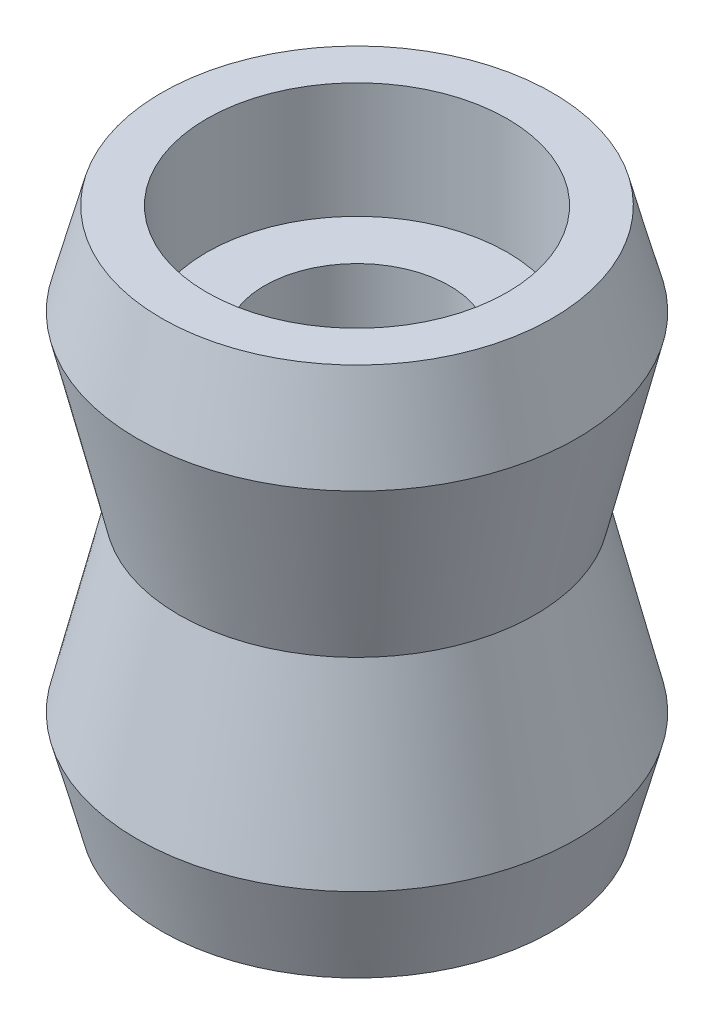
ISO-10303-21;
HEADER;
FILE_DESCRIPTION(('STEP AP214'),'2;1');
FILE_NAME('part.step','',(''),(''),'','','');
FILE_SCHEMA(('AUTOMOTIVE_DESIGN { 1 0 10303 214 1 1 1 1 }'));
ENDSEC;
DATA;
#1=APPLICATION_CONTEXT('core data for automotive mechanical design processes');
#2=APPLICATION_PROTOCOL_DEFINITION('international standard','automotive_design',2000,#1);
#3=PRODUCT_CONTEXT('',#1,'mechanical');
#4=PRODUCT('Part','Part','',(#3));
#5=PRODUCT_RELATED_PRODUCT_CATEGORY('part','',(#4));
#6=PRODUCT_DEFINITION_FORMATION('','',#4);
#7=PRODUCT_DEFINITION_CONTEXT('part definition',#1,'design');
#8=PRODUCT_DEFINITION('design','',#6,#7);
#9=PRODUCT_DEFINITION_SHAPE('','',#8);
#10=(LENGTH_UNIT() NAMED_UNIT(*) SI_UNIT(.MILLI.,.METRE.));
#11=(NAMED_UNIT(*) PLANE_ANGLE_UNIT() SI_UNIT($,.RADIAN.));
#12=(NAMED_UNIT(*) SI_UNIT($,.STERADIAN.) SOLID_ANGLE_UNIT());
#13=UNCERTAINTY_MEASURE_WITH_UNIT(LENGTH_MEASURE(1.E-05),#10,'distance_accuracy_value','');
#14=(GEOMETRIC_REPRESENTATION_CONTEXT(3) GLOBAL_UNCERTAINTY_ASSIGNED_CONTEXT((#13)) GLOBAL_UNIT_ASSIGNED_CONTEXT((#10,
#11,#12)) REPRESENTATION_CONTEXT('',''));
#15=CARTESIAN_POINT('',(0.,0.,0.));
#16=DIRECTION('',(0.,0.,1.));
#17=DIRECTION('',(1.,0.,0.));
#18=AXIS2_PLACEMENT_3D('',#15,#16,#17);
#19=CARTESIAN_POINT('',(0.,-8.28436697366508,0.));
#20=DIRECTION('',(0.,1.,0.));
#21=DIRECTION('',(0.,0.,1.));
#22=AXIS2_PLACEMENT_3D('',#19,#20,#21);
#23=CONICAL_SURFACE('',#22,8.44834512402877,0.258536651886108);
#24=CARTESIAN_POINT('',(0.,-4.30768321840881,0.));
#25=DIRECTION('',(0.,1.,0.));
#26=DIRECTION('',(0.,0.,1.));
#27=AXIS2_PLACEMENT_3D('',#24,#25,#26);
#28=CIRCLE('',#27,9.5);
#29=CARTESIAN_POINT('',(0.,-4.30768321840881,9.5));
#30=VERTEX_POINT('',#29);
#31=EDGE_CURVE('E68',#30,#30,#28,.T.);
#32=ORIENTED_EDGE('',*,*,#31,.F.);
#33=EDGE_LOOP('',(#32));
#34=FACE_BOUND('',#33,.T.);
#35=CARTESIAN_POINT('',(0.,-8.28436697366508,0.));
#36=DIRECTION('',(0.,1.,0.));
#37=DIRECTION('',(0.,0.,1.));
#38=AXIS2_PLACEMENT_3D('',#35,#36,#37);
#39=CIRCLE('',#38,8.44834512402877);
#40=CARTESIAN_POINT('',(0.,-8.28436697366508,8.44834512402877));
#41=VERTEX_POINT('',#40);
#42=EDGE_CURVE('E10',#41,#41,#39,.T.);
#43=ORIENTED_EDGE('',*,*,#42,.T.);
#44=EDGE_LOOP('',(#43));
#45=FACE_BOUND('',#44,.T.);
#46=ADVANCED_FACE('F31',(#34,#45),#23,.T.);
#47=CARTESIAN_POINT('',(6.5,-8.28436697366508,0.));
#48=DIRECTION('',(0.,1.,0.));
#49=DIRECTION('',(0.,0.,1.));
#50=AXIS2_PLACEMENT_3D('',#47,#48,#49);
#51=PLANE('',#50);
#52=ORIENTED_EDGE('',*,*,#42,.F.);
#53=EDGE_LOOP('',(#52));
#54=FACE_BOUND('',#53,.T.);
#55=CARTESIAN_POINT('',(0.,-8.28436697366508,0.));
#56=DIRECTION('',(0.,1.,0.));
#57=DIRECTION('',(0.,0.,1.));
#58=AXIS2_PLACEMENT_3D('',#55,#56,#57);
#59=CIRCLE('',#58,6.5);
#60=CARTESIAN_POINT('',(0.,-8.28436697366508,6.5));
#61=VERTEX_POINT('',#60);
#62=EDGE_CURVE('E37',#61,#61,#59,.T.);
#63=ORIENTED_EDGE('',*,*,#62,.T.);
#64=EDGE_LOOP('',(#63));
#65=FACE_BOUND('',#64,.T.);
#66=ADVANCED_FACE('F75',(#54,#65),#51,.F.);
#67=CARTESIAN_POINT('',(0.,42.3234558477177,0.));
#68=DIRECTION('',(0.,1.,0.));
#69=DIRECTION('',(0.,0.,1.));
#70=AXIS2_PLACEMENT_3D('',#67,#68,#69);
#71=CYLINDRICAL_SURFACE('',#70,6.5);
#72=ORIENTED_EDGE('',*,*,#62,.F.);
#73=EDGE_LOOP('',(#72));
#74=FACE_BOUND('',#73,.T.);
#75=CARTESIAN_POINT('',(0.,-3.28436697366508,0.));
#76=DIRECTION('',(0.,1.,0.));
#77=DIRECTION('',(0.,0.,1.));
#78=AXIS2_PLACEMENT_3D('',#75,#76,#77);
#79=CIRCLE('',#78,6.5);
#80=CARTESIAN_POINT('',(0.,-3.28436697366508,6.5));
#81=VERTEX_POINT('',#80);
#82=EDGE_CURVE('E41',#81,#81,#79,.T.);
#83=ORIENTED_EDGE('',*,*,#82,.T.);
#84=EDGE_LOOP('',(#83));
#85=FACE_BOUND('',#84,.T.);
#86=ADVANCED_FACE('F79',(#74,#85),#71,.F.);
#87=CARTESIAN_POINT('',(4.,-3.28436697366508,0.));
#88=DIRECTION('',(0.,1.,0.));
#89=DIRECTION('',(0.,0.,1.));
#90=AXIS2_PLACEMENT_3D('',#87,#88,#89);
#91=PLANE('',#90);
#92=ORIENTED_EDGE('',*,*,#82,.F.);
#93=EDGE_LOOP('',(#92));
#94=FACE_BOUND('',#93,.T.);
#95=CARTESIAN_POINT('',(0.,-3.28436697366508,0.));
#96=DIRECTION('',(0.,1.,0.));
#97=DIRECTION('',(0.,0.,1.));
#98=AXIS2_PLACEMENT_3D('',#95,#96,#97);
#99=CIRCLE('',#98,4.);
#100=CARTESIAN_POINT('',(0.,-3.28436697366508,4.));
#101=VERTEX_POINT('',#100);
#102=EDGE_CURVE('E45',#101,#101,#99,.T.);
#103=ORIENTED_EDGE('',*,*,#102,.T.);
#104=EDGE_LOOP('',(#103));
#105=FACE_BOUND('',#104,.T.);
#106=ADVANCED_FACE('F84',(#94,#105),#91,.F.);
#107=CARTESIAN_POINT('',(0.,42.3234558477177,0.));
#108=DIRECTION('',(0.,1.,0.));
#109=DIRECTION('',(0.,0.,1.));
#110=AXIS2_PLACEMENT_3D('',#107,#108,#109);
#111=CYLINDRICAL_SURFACE('',#110,4.);
#112=ORIENTED_EDGE('',*,*,#102,.F.);
#113=EDGE_LOOP('',(#112));
#114=FACE_BOUND('',#113,.T.);
#115=CARTESIAN_POINT('',(0.,9.66900053684746,0.));
#116=DIRECTION('',(0.,1.,0.));
#117=DIRECTION('',(0.,0.,1.));
#118=AXIS2_PLACEMENT_3D('',#115,#116,#117);
#119=CIRCLE('',#118,4.);
#120=CARTESIAN_POINT('',(0.,9.66900053684746,4.));
#121=VERTEX_POINT('',#120);
#122=EDGE_CURVE('E50',#121,#121,#119,.T.);
#123=ORIENTED_EDGE('',*,*,#122,.T.);
#124=EDGE_LOOP('',(#123));
#125=FACE_BOUND('',#124,.T.);
#126=ADVANCED_FACE('F90',(#114,#125),#111,.F.);
#127=CARTESIAN_POINT('',(4.,9.66900053684746,0.));
#128=DIRECTION('',(0.,-1.,0.));
#129=DIRECTION('',(0.,0.,-1.));
#130=AXIS2_PLACEMENT_3D('',#127,#128,#129);
#131=PLANE('',#130);
#132=ORIENTED_EDGE('',*,*,#122,.F.);
#133=EDGE_LOOP('',(#132));
#134=FACE_BOUND('',#133,.T.);
#135=CARTESIAN_POINT('',(0.,9.66900053684746,0.));
#136=DIRECTION('',(0.,1.,0.));
#137=DIRECTION('',(0.,0.,1.));
#138=AXIS2_PLACEMENT_3D('',#135,#136,#137);
#139=CIRCLE('',#138,6.5);
#140=CARTESIAN_POINT('',(0.,9.66900053684746,6.5));
#141=VERTEX_POINT('',#140);
#142=EDGE_CURVE('E53',#141,#141,#139,.T.);
#143=ORIENTED_EDGE('',*,*,#142,.T.);
#144=EDGE_LOOP('',(#143));
#145=FACE_BOUND('',#144,.T.);
#146=ADVANCED_FACE('F94',(#134,#145),#131,.F.);
#147=CARTESIAN_POINT('',(0.,42.3234558477177,0.));
#148=DIRECTION('',(0.,1.,0.));
#149=DIRECTION('',(0.,0.,1.));
#150=AXIS2_PLACEMENT_3D('',#147,#148,#149);
#151=CYLINDRICAL_SURFACE('',#150,6.5);
#152=ORIENTED_EDGE('',*,*,#142,.F.);
#153=EDGE_LOOP('',(#152));
#154=FACE_BOUND('',#153,.T.);
#155=CARTESIAN_POINT('',(0.,14.6690005368475,0.));
#156=DIRECTION('',(0.,1.,0.));
#157=DIRECTION('',(0.,0.,1.));
#158=AXIS2_PLACEMENT_3D('',#155,#156,#157);
#159=CIRCLE('',#158,6.5);
#160=CARTESIAN_POINT('',(0.,14.6690005368475,6.5));
#161=VERTEX_POINT('',#160);
#162=EDGE_CURVE('E56',#161,#161,#159,.T.);
#163=ORIENTED_EDGE('',*,*,#162,.T.);
#164=EDGE_LOOP('',(#163));
#165=FACE_BOUND('',#164,.T.);
#166=ADVANCED_FACE('F98',(#154,#165),#151,.F.);
#167=CARTESIAN_POINT('',(6.5,14.6690005368475,0.));
#168=DIRECTION('',(0.,-1.,0.));
#169=DIRECTION('',(0.,0.,-1.));
#170=AXIS2_PLACEMENT_3D('',#167,#168,#169);
#171=PLANE('',#170);
#172=ORIENTED_EDGE('',*,*,#162,.F.);
#173=EDGE_LOOP('',(#172));
#174=FACE_BOUND('',#173,.T.);
#175=CARTESIAN_POINT('',(0.,14.6690005368475,0.));
#176=DIRECTION('',(0.,1.,0.));
#177=DIRECTION('',(0.,0.,1.));
#178=AXIS2_PLACEMENT_3D('',#175,#176,#177);
#179=CIRCLE('',#178,8.44834512402877);
#180=CARTESIAN_POINT('',(0.,14.6690005368475,8.44834512402877));
#181=VERTEX_POINT('',#180);
#182=EDGE_CURVE('E59',#181,#181,#179,.T.);
#183=ORIENTED_EDGE('',*,*,#182,.T.);
#184=EDGE_LOOP('',(#183));
#185=FACE_BOUND('',#184,.T.);
#186=ADVANCED_FACE('F102',(#174,#185),#171,.F.);
#187=CARTESIAN_POINT('',(0.,10.6923167815912,0.));
#188=DIRECTION('',(0.,-1.,0.));
#189=DIRECTION('',(0.,0.,-1.));
#190=AXIS2_PLACEMENT_3D('',#187,#188,#189);
#191=CONICAL_SURFACE('',#190,9.5,0.258536651886108);
#192=ORIENTED_EDGE('',*,*,#182,.F.);
#193=EDGE_LOOP('',(#192));
#194=FACE_BOUND('',#193,.T.);
#195=CARTESIAN_POINT('',(0.,10.6923167815912,0.));
#196=DIRECTION('',(0.,1.,0.));
#197=DIRECTION('',(0.,0.,1.));
#198=AXIS2_PLACEMENT_3D('',#195,#196,#197);
#199=CIRCLE('',#198,9.5);
#200=CARTESIAN_POINT('',(0.,10.6923167815912,9.5));
#201=VERTEX_POINT('',#200);
#202=EDGE_CURVE('E62',#201,#201,#199,.T.);
#203=ORIENTED_EDGE('',*,*,#202,.T.);
#204=EDGE_LOOP('',(#203));
#205=FACE_BOUND('',#204,.T.);
#206=ADVANCED_FACE('F106',(#194,#205),#191,.T.);
#207=CARTESIAN_POINT('',(0.,3.19231678159119,0.));
#208=DIRECTION('',(0.,1.,0.));
#209=DIRECTION('',(0.,0.,1.));
#210=AXIS2_PLACEMENT_3D('',#207,#208,#209);
#211=CONICAL_SURFACE('',#210,7.7,0.235544980720863);
#212=ORIENTED_EDGE('',*,*,#202,.F.);
#213=EDGE_LOOP('',(#212));
#214=FACE_BOUND('',#213,.T.);
#215=CARTESIAN_POINT('',(0.,3.19231678159119,0.));
#216=DIRECTION('',(0.,1.,0.));
#217=DIRECTION('',(0.,0.,1.));
#218=AXIS2_PLACEMENT_3D('',#215,#216,#217);
#219=CIRCLE('',#218,7.7);
#220=CARTESIAN_POINT('',(0.,3.19231678159119,7.7));
#221=VERTEX_POINT('',#220);
#222=EDGE_CURVE('E65',#221,#221,#219,.T.);
#223=ORIENTED_EDGE('',*,*,#222,.T.);
#224=EDGE_LOOP('',(#223));
#225=FACE_BOUND('',#224,.T.);
#226=ADVANCED_FACE('F110',(#214,#225),#211,.T.);
#227=CARTESIAN_POINT('',(0.,-4.30768321840881,0.));
#228=DIRECTION('',(0.,-1.,0.));
#229=DIRECTION('',(0.,0.,-1.));
#230=AXIS2_PLACEMENT_3D('',#227,#228,#229);
#231=CONICAL_SURFACE('',#230,9.5,0.235544980720863);
#232=ORIENTED_EDGE('',*,*,#222,.F.);
#233=EDGE_LOOP('',(#232));
#234=FACE_BOUND('',#233,.T.);
#235=ORIENTED_EDGE('',*,*,#31,.T.);
#236=EDGE_LOOP('',(#235));
#237=FACE_BOUND('',#236,.T.);
#238=ADVANCED_FACE('F72',(#234,#237),#231,.T.);
#239=CLOSED_SHELL('',(#46,#66,#86,#106,#126,#146,#166,#186,#206,#226,#238));
#240=MANIFOLD_SOLID_BREP('B2',#239);
#241=ADVANCED_BREP_SHAPE_REPRESENTATION('',(#18,#240),#14);
#242=SHAPE_DEFINITION_REPRESENTATION(#9,#241);
ENDSEC;
END-ISO-10303-21;
